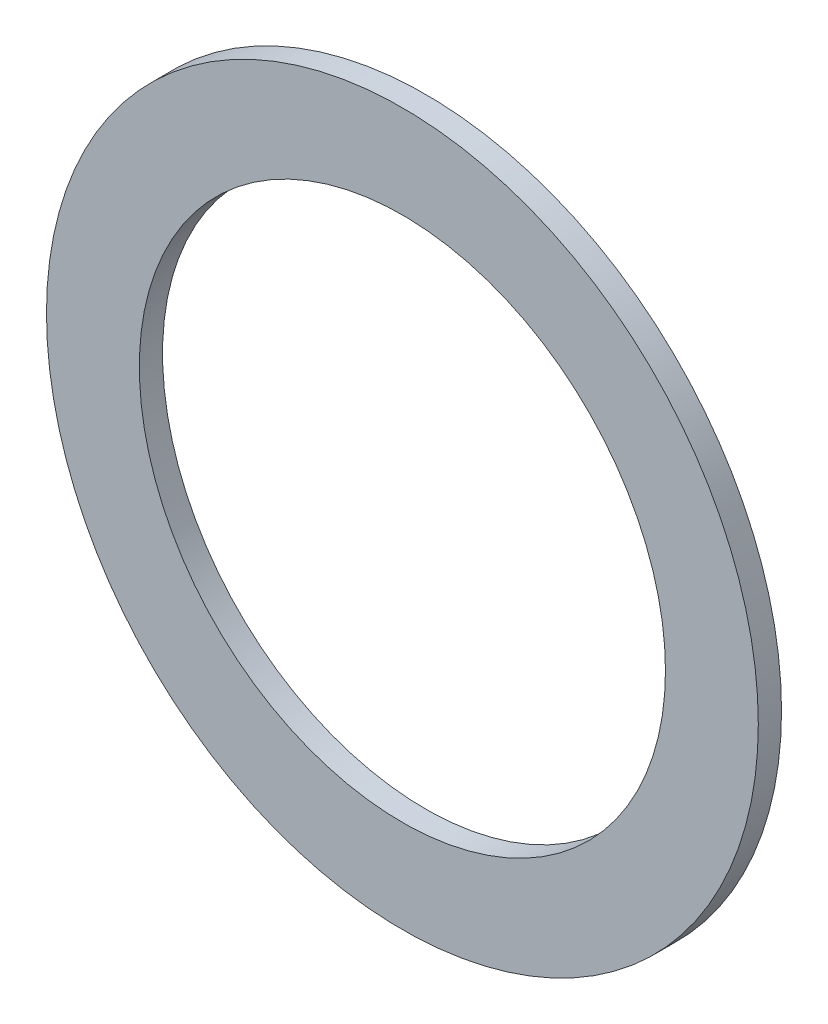
ISO-10303-21;
HEADER;
FILE_DESCRIPTION(('STEP AP214'),'2;1');
FILE_NAME('part.step','',(''),(''),'','','');
FILE_SCHEMA(('AUTOMOTIVE_DESIGN { 1 0 10303 214 1 1 1 1 }'));
ENDSEC;
DATA;
#1=APPLICATION_CONTEXT('core data for automotive mechanical design processes');
#2=APPLICATION_PROTOCOL_DEFINITION('international standard','automotive_design',2000,#1);
#3=PRODUCT_CONTEXT('',#1,'mechanical');
#4=PRODUCT('Part','Part','',(#3));
#5=PRODUCT_RELATED_PRODUCT_CATEGORY('part','',(#4));
#6=PRODUCT_DEFINITION_FORMATION('','',#4);
#7=PRODUCT_DEFINITION_CONTEXT('part definition',#1,'design');
#8=PRODUCT_DEFINITION('design','',#6,#7);
#9=PRODUCT_DEFINITION_SHAPE('','',#8);
#10=(LENGTH_UNIT() NAMED_UNIT(*) SI_UNIT(.MILLI.,.METRE.));
#11=(NAMED_UNIT(*) PLANE_ANGLE_UNIT() SI_UNIT($,.RADIAN.));
#12=(NAMED_UNIT(*) SI_UNIT($,.STERADIAN.) SOLID_ANGLE_UNIT());
#13=UNCERTAINTY_MEASURE_WITH_UNIT(LENGTH_MEASURE(1.E-05),#10,'distance_accuracy_value','');
#14=(GEOMETRIC_REPRESENTATION_CONTEXT(3) GLOBAL_UNCERTAINTY_ASSIGNED_CONTEXT((#13)) GLOBAL_UNIT_ASSIGNED_CONTEXT((#10,
#11,#12)) REPRESENTATION_CONTEXT('',''));
#15=CARTESIAN_POINT('',(0.,0.,0.));
#16=DIRECTION('',(0.,0.,1.));
#17=DIRECTION('',(1.,0.,0.));
#18=AXIS2_PLACEMENT_3D('',#15,#16,#17);
#19=CARTESIAN_POINT('',(0.,0.,1.5));
#20=DIRECTION('',(0.,0.,1.));
#21=DIRECTION('',(1.,0.,0.));
#22=AXIS2_PLACEMENT_3D('',#19,#20,#21);
#23=PLANE('',#22);
#24=CARTESIAN_POINT('',(0.,0.,1.5));
#25=DIRECTION('',(0.,0.,1.));
#26=DIRECTION('',(1.,0.,0.));
#27=AXIS2_PLACEMENT_3D('',#24,#25,#26);
#28=CIRCLE('',#27,23.);
#29=CARTESIAN_POINT('',(23.,0.,1.5));
#30=VERTEX_POINT('',#29);
#31=EDGE_CURVE('E10',#30,#30,#28,.T.);
#32=ORIENTED_EDGE('',*,*,#31,.T.);
#33=EDGE_LOOP('',(#32));
#34=FACE_BOUND('',#33,.T.);
#35=CARTESIAN_POINT('',(0.,0.,1.5));
#36=DIRECTION('',(0.,0.,1.));
#37=DIRECTION('',(1.,0.,0.));
#38=AXIS2_PLACEMENT_3D('',#35,#36,#37);
#39=CIRCLE('',#38,17.);
#40=CARTESIAN_POINT('',(17.,0.,1.5));
#41=VERTEX_POINT('',#40);
#42=EDGE_CURVE('E41',#41,#41,#39,.T.);
#43=ORIENTED_EDGE('',*,*,#42,.F.);
#44=EDGE_LOOP('',(#43));
#45=FACE_BOUND('',#44,.T.);
#46=ADVANCED_FACE('F30',(#34,#45),#23,.T.);
#47=CARTESIAN_POINT('',(0.,0.,0.));
#48=DIRECTION('',(0.,0.,1.));
#49=DIRECTION('',(1.,0.,0.));
#50=AXIS2_PLACEMENT_3D('',#47,#48,#49);
#51=PLANE('',#50);
#52=CARTESIAN_POINT('',(0.,0.,0.));
#53=DIRECTION('',(0.,0.,1.));
#54=DIRECTION('',(1.,0.,0.));
#55=AXIS2_PLACEMENT_3D('',#52,#53,#54);
#56=CIRCLE('',#55,23.);
#57=CARTESIAN_POINT('',(23.,0.,0.));
#58=VERTEX_POINT('',#57);
#59=EDGE_CURVE('E34',#58,#58,#56,.T.);
#60=ORIENTED_EDGE('',*,*,#59,.F.);
#61=EDGE_LOOP('',(#60));
#62=FACE_BOUND('',#61,.T.);
#63=CARTESIAN_POINT('',(0.,0.,0.));
#64=DIRECTION('',(0.,0.,1.));
#65=DIRECTION('',(1.,0.,0.));
#66=AXIS2_PLACEMENT_3D('',#63,#64,#65);
#67=CIRCLE('',#66,17.);
#68=CARTESIAN_POINT('',(17.,0.,0.));
#69=VERTEX_POINT('',#68);
#70=EDGE_CURVE('E43',#69,#69,#67,.T.);
#71=ORIENTED_EDGE('',*,*,#70,.T.);
#72=EDGE_LOOP('',(#71));
#73=FACE_BOUND('',#72,.T.);
#74=ADVANCED_FACE('F53',(#62,#73),#51,.F.);
#75=CARTESIAN_POINT('',(0.,0.,1.5));
#76=DIRECTION('',(0.,0.,-1.));
#77=DIRECTION('',(-1.,0.,0.));
#78=AXIS2_PLACEMENT_3D('',#75,#76,#77);
#79=CYLINDRICAL_SURFACE('',#78,23.);
#80=ORIENTED_EDGE('',*,*,#31,.F.);
#81=EDGE_LOOP('',(#80));
#82=FACE_BOUND('',#81,.T.);
#83=ORIENTED_EDGE('',*,*,#59,.T.);
#84=EDGE_LOOP('',(#83));
#85=FACE_BOUND('',#84,.T.);
#86=ADVANCED_FACE('F32',(#82,#85),#79,.T.);
#87=CARTESIAN_POINT('',(0.,0.,1.5));
#88=DIRECTION('',(0.,0.,-1.));
#89=DIRECTION('',(-1.,0.,0.));
#90=AXIS2_PLACEMENT_3D('',#87,#88,#89);
#91=CYLINDRICAL_SURFACE('',#90,17.);
#92=ORIENTED_EDGE('',*,*,#42,.T.);
#93=EDGE_LOOP('',(#92));
#94=FACE_BOUND('',#93,.T.);
#95=ORIENTED_EDGE('',*,*,#70,.F.);
#96=EDGE_LOOP('',(#95));
#97=FACE_BOUND('',#96,.T.);
#98=ADVANCED_FACE('F49',(#94,#97),#91,.F.);
#99=CLOSED_SHELL('',(#46,#74,#86,#98));
#100=MANIFOLD_SOLID_BREP('B2',#99);
#101=ADVANCED_BREP_SHAPE_REPRESENTATION('',(#18,#100),#14);
#102=SHAPE_DEFINITION_REPRESENTATION(#9,#101);
ENDSEC;
END-ISO-10303-21;
